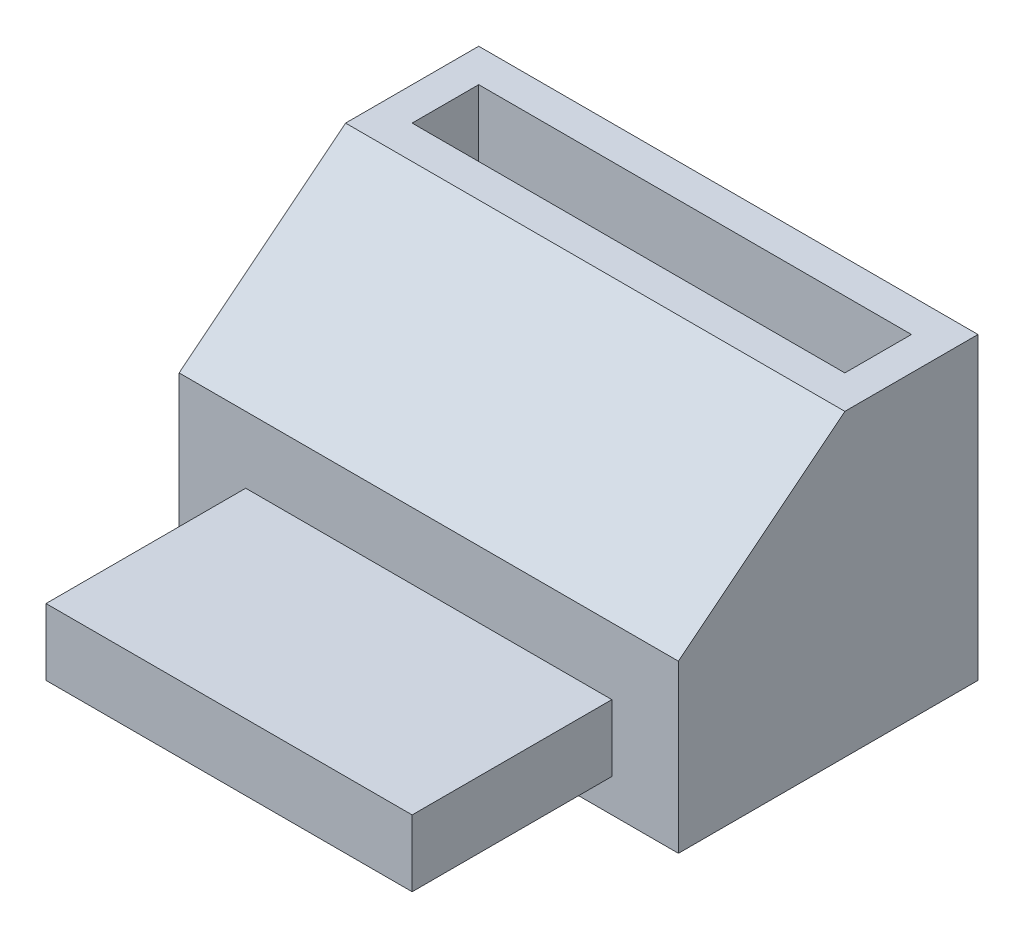
ISO-10303-21;
HEADER;
FILE_DESCRIPTION(('STEP AP214'),'2;1');
FILE_NAME('part.step','',(''),(''),'','','');
FILE_SCHEMA(('AUTOMOTIVE_DESIGN { 1 0 10303 214 1 1 1 1 }'));
ENDSEC;
DATA;
#1=APPLICATION_CONTEXT('core data for automotive mechanical design processes');
#2=APPLICATION_PROTOCOL_DEFINITION('international standard','automotive_design',2000,#1);
#3=PRODUCT_CONTEXT('',#1,'mechanical');
#4=PRODUCT('Part','Part','',(#3));
#5=PRODUCT_RELATED_PRODUCT_CATEGORY('part','',(#4));
#6=PRODUCT_DEFINITION_FORMATION('','',#4);
#7=PRODUCT_DEFINITION_CONTEXT('part definition',#1,'design');
#8=PRODUCT_DEFINITION('design','',#6,#7);
#9=PRODUCT_DEFINITION_SHAPE('','',#8);
#10=(LENGTH_UNIT() NAMED_UNIT(*) SI_UNIT(.MILLI.,.METRE.));
#11=(NAMED_UNIT(*) PLANE_ANGLE_UNIT() SI_UNIT($,.RADIAN.));
#12=(NAMED_UNIT(*) SI_UNIT($,.STERADIAN.) SOLID_ANGLE_UNIT());
#13=UNCERTAINTY_MEASURE_WITH_UNIT(LENGTH_MEASURE(1.E-05),#10,'distance_accuracy_value','');
#14=(GEOMETRIC_REPRESENTATION_CONTEXT(3) GLOBAL_UNCERTAINTY_ASSIGNED_CONTEXT((#13)) GLOBAL_UNIT_ASSIGNED_CONTEXT((#10,
#11,#12)) REPRESENTATION_CONTEXT('',''));
#15=CARTESIAN_POINT('',(0.,0.,0.));
#16=DIRECTION('',(0.,0.,1.));
#17=DIRECTION('',(1.,0.,0.));
#18=AXIS2_PLACEMENT_3D('',#15,#16,#17);
#19=CARTESIAN_POINT('',(150.,50.,90.));
#20=DIRECTION('',(0.,0.,-1.));
#21=DIRECTION('',(-1.,0.,0.));
#22=AXIS2_PLACEMENT_3D('',#19,#20,#21);
#23=PLANE('',#22);
#24=DIRECTION('',(0.,-1.,0.));
#25=VECTOR('',#24,1.);
#26=CARTESIAN_POINT('',(0.,50.,90.));
#27=LINE('',#26,#25);
#28=CARTESIAN_POINT('',(0.,50.,90.));
#29=VERTEX_POINT('',#28);
#30=CARTESIAN_POINT('',(0.,0.,90.));
#31=VERTEX_POINT('',#30);
#32=EDGE_CURVE('E203',#29,#31,#27,.T.);
#33=ORIENTED_EDGE('',*,*,#32,.T.);
#34=DIRECTION('',(-1.,0.,0.));
#35=VECTOR('',#34,1.);
#36=CARTESIAN_POINT('',(150.,0.,90.));
#37=LINE('',#36,#35);
#38=CARTESIAN_POINT('',(150.,0.,90.));
#39=VERTEX_POINT('',#38);
#40=EDGE_CURVE('E211',#39,#31,#37,.T.);
#41=ORIENTED_EDGE('',*,*,#40,.F.);
#42=DIRECTION('',(0.,-1.,0.));
#43=VECTOR('',#42,1.);
#44=CARTESIAN_POINT('',(150.,50.,90.));
#45=LINE('',#44,#43);
#46=CARTESIAN_POINT('',(150.,50.,90.));
#47=VERTEX_POINT('',#46);
#48=EDGE_CURVE('E209',#47,#39,#45,.T.);
#49=ORIENTED_EDGE('',*,*,#48,.F.);
#50=DIRECTION('',(-1.,0.,0.));
#51=VECTOR('',#50,1.);
#52=CARTESIAN_POINT('',(150.,50.,90.));
#53=LINE('',#52,#51);
#54=EDGE_CURVE('E223',#47,#29,#53,.T.);
#55=ORIENTED_EDGE('',*,*,#54,.T.);
#56=EDGE_LOOP('',(#33,#41,#49,#55));
#57=FACE_BOUND('',#56,.T.);
#58=DIRECTION('',(0.,-1.,0.));
#59=VECTOR('',#58,1.);
#60=CARTESIAN_POINT('',(20.,30.,90.));
#61=LINE('',#60,#59);
#62=CARTESIAN_POINT('',(20.,30.,90.));
#63=VERTEX_POINT('',#62);
#64=CARTESIAN_POINT('',(20.,10.,90.));
#65=VERTEX_POINT('',#64);
#66=EDGE_CURVE('E165',#63,#65,#61,.T.);
#67=ORIENTED_EDGE('',*,*,#66,.F.);
#68=DIRECTION('',(-1.,0.,0.));
#69=VECTOR('',#68,1.);
#70=CARTESIAN_POINT('',(20.,30.,90.));
#71=LINE('',#70,#69);
#72=CARTESIAN_POINT('',(130.,30.,90.));
#73=VERTEX_POINT('',#72);
#74=EDGE_CURVE('E173',#73,#63,#71,.T.);
#75=ORIENTED_EDGE('',*,*,#74,.F.);
#76=DIRECTION('',(0.,1.,0.));
#77=VECTOR('',#76,1.);
#78=CARTESIAN_POINT('',(130.,30.,90.));
#79=LINE('',#78,#77);
#80=CARTESIAN_POINT('',(130.,10.,90.));
#81=VERTEX_POINT('',#80);
#82=EDGE_CURVE('E183',#81,#73,#79,.T.);
#83=ORIENTED_EDGE('',*,*,#82,.F.);
#84=DIRECTION('',(1.,0.,0.));
#85=VECTOR('',#84,1.);
#86=CARTESIAN_POINT('',(20.,10.,90.));
#87=LINE('',#86,#85);
#88=EDGE_CURVE('E58',#65,#81,#87,.T.);
#89=ORIENTED_EDGE('',*,*,#88,.F.);
#90=EDGE_LOOP('',(#67,#75,#83,#89));
#91=FACE_BOUND('',#90,.T.);
#92=ADVANCED_FACE('F35',(#57,#91),#23,.F.);
#93=CARTESIAN_POINT('',(150.,0.,90.));
#94=DIRECTION('',(0.,1.,0.));
#95=DIRECTION('',(0.,0.,1.));
#96=AXIS2_PLACEMENT_3D('',#93,#94,#95);
#97=PLANE('',#96);
#98=DIRECTION('',(0.,0.,-1.));
#99=VECTOR('',#98,1.);
#100=CARTESIAN_POINT('',(0.,0.,90.));
#101=LINE('',#100,#99);
#102=CARTESIAN_POINT('',(0.,0.,0.));
#103=VERTEX_POINT('',#102);
#104=EDGE_CURVE('E198',#31,#103,#101,.T.);
#105=ORIENTED_EDGE('',*,*,#104,.T.);
#106=DIRECTION('',(-1.,0.,0.));
#107=VECTOR('',#106,1.);
#108=CARTESIAN_POINT('',(150.,0.,0.));
#109=LINE('',#108,#107);
#110=CARTESIAN_POINT('',(150.,0.,0.));
#111=VERTEX_POINT('',#110);
#112=EDGE_CURVE('E11',#111,#103,#109,.T.);
#113=ORIENTED_EDGE('',*,*,#112,.F.);
#114=DIRECTION('',(0.,0.,-1.));
#115=VECTOR('',#114,1.);
#116=CARTESIAN_POINT('',(150.,0.,90.));
#117=LINE('',#116,#115);
#118=EDGE_CURVE('E199',#39,#111,#117,.T.);
#119=ORIENTED_EDGE('',*,*,#118,.F.);
#120=ORIENTED_EDGE('',*,*,#40,.T.);
#121=EDGE_LOOP('',(#105,#113,#119,#120));
#122=FACE_BOUND('',#121,.T.);
#123=ADVANCED_FACE('F37',(#122),#97,.F.);
#124=CARTESIAN_POINT('',(150.,0.,0.));
#125=DIRECTION('',(0.,0.,1.));
#126=DIRECTION('',(1.,0.,0.));
#127=AXIS2_PLACEMENT_3D('',#124,#125,#126);
#128=PLANE('',#127);
#129=DIRECTION('',(0.,1.,0.));
#130=VECTOR('',#129,1.);
#131=CARTESIAN_POINT('',(0.,0.,0.));
#132=LINE('',#131,#130);
#133=CARTESIAN_POINT('',(0.,90.,0.));
#134=VERTEX_POINT('',#133);
#135=EDGE_CURVE('E214',#103,#134,#132,.T.);
#136=ORIENTED_EDGE('',*,*,#135,.T.);
#137=DIRECTION('',(-1.,0.,0.));
#138=VECTOR('',#137,1.);
#139=CARTESIAN_POINT('',(150.,90.,0.));
#140=LINE('',#139,#138);
#141=CARTESIAN_POINT('',(150.,90.,0.));
#142=VERTEX_POINT('',#141);
#143=EDGE_CURVE('E43',#142,#134,#140,.T.);
#144=ORIENTED_EDGE('',*,*,#143,.F.);
#145=DIRECTION('',(0.,1.,0.));
#146=VECTOR('',#145,1.);
#147=CARTESIAN_POINT('',(150.,0.,0.));
#148=LINE('',#147,#146);
#149=EDGE_CURVE('E202',#111,#142,#148,.T.);
#150=ORIENTED_EDGE('',*,*,#149,.F.);
#151=ORIENTED_EDGE('',*,*,#112,.T.);
#152=EDGE_LOOP('',(#136,#144,#150,#151));
#153=FACE_BOUND('',#152,.T.);
#154=ADVANCED_FACE('F252',(#153),#128,.F.);
#155=CARTESIAN_POINT('',(150.,90.,0.));
#156=DIRECTION('',(0.,-1.,0.));
#157=DIRECTION('',(0.,0.,-1.));
#158=AXIS2_PLACEMENT_3D('',#155,#156,#157);
#159=PLANE('',#158);
#160=DIRECTION('',(1.,0.,0.));
#161=VECTOR('',#160,1.);
#162=CARTESIAN_POINT('',(10.,90.,30.));
#163=LINE('',#162,#161);
#164=CARTESIAN_POINT('',(10.,90.,30.));
#165=VERTEX_POINT('',#164);
#166=CARTESIAN_POINT('',(140.,90.,30.));
#167=VERTEX_POINT('',#166);
#168=EDGE_CURVE('E159',#165,#167,#163,.T.);
#169=ORIENTED_EDGE('',*,*,#168,.F.);
#170=DIRECTION('',(0.,0.,1.));
#171=VECTOR('',#170,1.);
#172=CARTESIAN_POINT('',(10.,90.,10.));
#173=LINE('',#172,#171);
#174=CARTESIAN_POINT('',(10.,90.,10.));
#175=VERTEX_POINT('',#174);
#176=EDGE_CURVE('E50',#175,#165,#173,.T.);
#177=ORIENTED_EDGE('',*,*,#176,.F.);
#178=DIRECTION('',(-1.,0.,0.));
#179=VECTOR('',#178,1.);
#180=CARTESIAN_POINT('',(10.,90.,10.));
#181=LINE('',#180,#179);
#182=CARTESIAN_POINT('',(140.,90.,10.));
#183=VERTEX_POINT('',#182);
#184=EDGE_CURVE('E150',#183,#175,#181,.T.);
#185=ORIENTED_EDGE('',*,*,#184,.F.);
#186=DIRECTION('',(0.,0.,-1.));
#187=VECTOR('',#186,1.);
#188=CARTESIAN_POINT('',(140.,90.,10.));
#189=LINE('',#188,#187);
#190=EDGE_CURVE('E153',#167,#183,#189,.T.);
#191=ORIENTED_EDGE('',*,*,#190,.F.);
#192=EDGE_LOOP('',(#169,#177,#185,#191));
#193=FACE_BOUND('',#192,.T.);
#194=DIRECTION('',(0.,0.,1.));
#195=VECTOR('',#194,1.);
#196=CARTESIAN_POINT('',(0.,90.,0.));
#197=LINE('',#196,#195);
#198=CARTESIAN_POINT('',(0.,90.,40.));
#199=VERTEX_POINT('',#198);
#200=EDGE_CURVE('E216',#134,#199,#197,.T.);
#201=ORIENTED_EDGE('',*,*,#200,.T.);
#202=DIRECTION('',(-1.,0.,0.));
#203=VECTOR('',#202,1.);
#204=CARTESIAN_POINT('',(150.,90.,40.));
#205=LINE('',#204,#203);
#206=CARTESIAN_POINT('',(150.,90.,40.));
#207=VERTEX_POINT('',#206);
#208=EDGE_CURVE('E226',#207,#199,#205,.T.);
#209=ORIENTED_EDGE('',*,*,#208,.F.);
#210=DIRECTION('',(0.,0.,1.));
#211=VECTOR('',#210,1.);
#212=CARTESIAN_POINT('',(150.,90.,0.));
#213=LINE('',#212,#211);
#214=EDGE_CURVE('E205',#142,#207,#213,.T.);
#215=ORIENTED_EDGE('',*,*,#214,.F.);
#216=ORIENTED_EDGE('',*,*,#143,.T.);
#217=EDGE_LOOP('',(#201,#209,#215,#216));
#218=FACE_BOUND('',#217,.T.);
#219=ADVANCED_FACE('F233',(#193,#218),#159,.F.);
#220=CARTESIAN_POINT('',(150.,90.,40.));
#221=DIRECTION('',(0.,-0.78086880944303,-0.624695047554424));
#222=DIRECTION('',(0.,0.624695047554424,-0.78086880944303));
#223=AXIS2_PLACEMENT_3D('',#220,#221,#222);
#224=PLANE('',#223);
#225=DIRECTION('',(0.,-0.624695047554424,0.78086880944303));
#226=VECTOR('',#225,1.);
#227=CARTESIAN_POINT('',(0.,90.,40.));
#228=LINE('',#227,#226);
#229=EDGE_CURVE('E218',#199,#29,#228,.T.);
#230=ORIENTED_EDGE('',*,*,#229,.T.);
#231=ORIENTED_EDGE('',*,*,#54,.F.);
#232=DIRECTION('',(0.,-0.624695047554424,0.78086880944303));
#233=VECTOR('',#232,1.);
#234=CARTESIAN_POINT('',(150.,90.,40.));
#235=LINE('',#234,#233);
#236=EDGE_CURVE('E207',#207,#47,#235,.T.);
#237=ORIENTED_EDGE('',*,*,#236,.F.);
#238=ORIENTED_EDGE('',*,*,#208,.T.);
#239=EDGE_LOOP('',(#230,#231,#237,#238));
#240=FACE_BOUND('',#239,.T.);
#241=ADVANCED_FACE('F243',(#240),#224,.F.);
#242=CARTESIAN_POINT('',(150.,0.,0.));
#243=DIRECTION('',(1.,0.,0.));
#244=DIRECTION('',(0.,0.,-1.));
#245=AXIS2_PLACEMENT_3D('',#242,#243,#244);
#246=PLANE('',#245);
#247=ORIENTED_EDGE('',*,*,#118,.T.);
#248=ORIENTED_EDGE('',*,*,#149,.T.);
#249=ORIENTED_EDGE('',*,*,#214,.T.);
#250=ORIENTED_EDGE('',*,*,#236,.T.);
#251=ORIENTED_EDGE('',*,*,#48,.T.);
#252=EDGE_LOOP('',(#247,#248,#249,#250,#251));
#253=FACE_BOUND('',#252,.T.);
#254=ADVANCED_FACE('F250',(#253),#246,.T.);
#255=CARTESIAN_POINT('',(0.,0.,0.));
#256=DIRECTION('',(1.,0.,0.));
#257=DIRECTION('',(0.,0.,-1.));
#258=AXIS2_PLACEMENT_3D('',#255,#256,#257);
#259=PLANE('',#258);
#260=ORIENTED_EDGE('',*,*,#104,.F.);
#261=ORIENTED_EDGE('',*,*,#32,.F.);
#262=ORIENTED_EDGE('',*,*,#229,.F.);
#263=ORIENTED_EDGE('',*,*,#200,.F.);
#264=ORIENTED_EDGE('',*,*,#135,.F.);
#265=EDGE_LOOP('',(#260,#261,#262,#263,#264));
#266=FACE_BOUND('',#265,.T.);
#267=ADVANCED_FACE('F239',(#266),#259,.F.);
#268=CARTESIAN_POINT('',(20.,30.,150.));
#269=DIRECTION('',(1.,0.,0.));
#270=DIRECTION('',(0.,1.,0.));
#271=AXIS2_PLACEMENT_3D('',#268,#269,#270);
#272=PLANE('',#271);
#273=ORIENTED_EDGE('',*,*,#66,.T.);
#274=DIRECTION('',(0.,0.,-1.));
#275=VECTOR('',#274,1.);
#276=CARTESIAN_POINT('',(20.,10.,150.));
#277=LINE('',#276,#275);
#278=CARTESIAN_POINT('',(20.,10.,150.));
#279=VERTEX_POINT('',#278);
#280=EDGE_CURVE('E196',#279,#65,#277,.T.);
#281=ORIENTED_EDGE('',*,*,#280,.F.);
#282=DIRECTION('',(0.,-1.,0.));
#283=VECTOR('',#282,1.);
#284=CARTESIAN_POINT('',(20.,30.,150.));
#285=LINE('',#284,#283);
#286=CARTESIAN_POINT('',(20.,30.,150.));
#287=VERTEX_POINT('',#286);
#288=EDGE_CURVE('E169',#287,#279,#285,.T.);
#289=ORIENTED_EDGE('',*,*,#288,.F.);
#290=DIRECTION('',(0.,0.,-1.));
#291=VECTOR('',#290,1.);
#292=CARTESIAN_POINT('',(20.,30.,150.));
#293=LINE('',#292,#291);
#294=EDGE_CURVE('E179',#287,#63,#293,.T.);
#295=ORIENTED_EDGE('',*,*,#294,.T.);
#296=EDGE_LOOP('',(#273,#281,#289,#295));
#297=FACE_BOUND('',#296,.T.);
#298=ADVANCED_FACE('F304',(#297),#272,.F.);
#299=CARTESIAN_POINT('',(20.,10.,150.));
#300=DIRECTION('',(0.,1.,0.));
#301=DIRECTION('',(-1.,0.,0.));
#302=AXIS2_PLACEMENT_3D('',#299,#300,#301);
#303=PLANE('',#302);
#304=ORIENTED_EDGE('',*,*,#88,.T.);
#305=DIRECTION('',(0.,0.,-1.));
#306=VECTOR('',#305,1.);
#307=CARTESIAN_POINT('',(130.,10.,150.));
#308=LINE('',#307,#306);
#309=CARTESIAN_POINT('',(130.,10.,150.));
#310=VERTEX_POINT('',#309);
#311=EDGE_CURVE('E193',#310,#81,#308,.T.);
#312=ORIENTED_EDGE('',*,*,#311,.F.);
#313=DIRECTION('',(1.,0.,0.));
#314=VECTOR('',#313,1.);
#315=CARTESIAN_POINT('',(20.,10.,150.));
#316=LINE('',#315,#314);
#317=EDGE_CURVE('E172',#279,#310,#316,.T.);
#318=ORIENTED_EDGE('',*,*,#317,.F.);
#319=ORIENTED_EDGE('',*,*,#280,.T.);
#320=EDGE_LOOP('',(#304,#312,#318,#319));
#321=FACE_BOUND('',#320,.T.);
#322=ADVANCED_FACE('F300',(#321),#303,.F.);
#323=CARTESIAN_POINT('',(130.,30.,150.));
#324=DIRECTION('',(-1.,0.,0.));
#325=DIRECTION('',(0.,0.,1.));
#326=AXIS2_PLACEMENT_3D('',#323,#324,#325);
#327=PLANE('',#326);
#328=ORIENTED_EDGE('',*,*,#82,.T.);
#329=DIRECTION('',(0.,0.,-1.));
#330=VECTOR('',#329,1.);
#331=CARTESIAN_POINT('',(130.,30.,150.));
#332=LINE('',#331,#330);
#333=CARTESIAN_POINT('',(130.,30.,150.));
#334=VERTEX_POINT('',#333);
#335=EDGE_CURVE('E190',#334,#73,#332,.T.);
#336=ORIENTED_EDGE('',*,*,#335,.F.);
#337=DIRECTION('',(0.,1.,0.));
#338=VECTOR('',#337,1.);
#339=CARTESIAN_POINT('',(130.,30.,150.));
#340=LINE('',#339,#338);
#341=EDGE_CURVE('E175',#310,#334,#340,.T.);
#342=ORIENTED_EDGE('',*,*,#341,.F.);
#343=ORIENTED_EDGE('',*,*,#311,.T.);
#344=EDGE_LOOP('',(#328,#336,#342,#343));
#345=FACE_BOUND('',#344,.T.);
#346=ADVANCED_FACE('F296',(#345),#327,.F.);
#347=CARTESIAN_POINT('',(20.,30.,150.));
#348=DIRECTION('',(0.,-1.,0.));
#349=DIRECTION('',(0.,0.,-1.));
#350=AXIS2_PLACEMENT_3D('',#347,#348,#349);
#351=PLANE('',#350);
#352=ORIENTED_EDGE('',*,*,#74,.T.);
#353=ORIENTED_EDGE('',*,*,#294,.F.);
#354=DIRECTION('',(-1.,0.,0.));
#355=VECTOR('',#354,1.);
#356=CARTESIAN_POINT('',(20.,30.,150.));
#357=LINE('',#356,#355);
#358=EDGE_CURVE('E177',#334,#287,#357,.T.);
#359=ORIENTED_EDGE('',*,*,#358,.F.);
#360=ORIENTED_EDGE('',*,*,#335,.T.);
#361=EDGE_LOOP('',(#352,#353,#359,#360));
#362=FACE_BOUND('',#361,.T.);
#363=ADVANCED_FACE('F292',(#362),#351,.F.);
#364=CARTESIAN_POINT('',(0.,0.,150.));
#365=DIRECTION('',(0.,0.,1.));
#366=DIRECTION('',(1.,0.,0.));
#367=AXIS2_PLACEMENT_3D('',#364,#365,#366);
#368=PLANE('',#367);
#369=ORIENTED_EDGE('',*,*,#288,.T.);
#370=ORIENTED_EDGE('',*,*,#317,.T.);
#371=ORIENTED_EDGE('',*,*,#341,.T.);
#372=ORIENTED_EDGE('',*,*,#358,.T.);
#373=EDGE_LOOP('',(#369,#370,#371,#372));
#374=FACE_BOUND('',#373,.T.);
#375=ADVANCED_FACE('F284',(#374),#368,.T.);
#376=CARTESIAN_POINT('',(10.,30.,10.));
#377=DIRECTION('',(-1.,0.,0.));
#378=DIRECTION('',(0.,0.,1.));
#379=AXIS2_PLACEMENT_3D('',#376,#377,#378);
#380=PLANE('',#379);
#381=ORIENTED_EDGE('',*,*,#176,.T.);
#382=DIRECTION('',(0.,1.,0.));
#383=VECTOR('',#382,1.);
#384=CARTESIAN_POINT('',(10.,30.,30.));
#385=LINE('',#384,#383);
#386=CARTESIAN_POINT('',(10.,30.,30.));
#387=VERTEX_POINT('',#386);
#388=EDGE_CURVE('E128',#387,#165,#385,.T.);
#389=ORIENTED_EDGE('',*,*,#388,.F.);
#390=DIRECTION('',(0.,0.,1.));
#391=VECTOR('',#390,1.);
#392=CARTESIAN_POINT('',(10.,30.,10.));
#393=LINE('',#392,#391);
#394=CARTESIAN_POINT('',(10.,30.,10.));
#395=VERTEX_POINT('',#394);
#396=EDGE_CURVE('E132',#395,#387,#393,.T.);
#397=ORIENTED_EDGE('',*,*,#396,.F.);
#398=DIRECTION('',(0.,1.,0.));
#399=VECTOR('',#398,1.);
#400=CARTESIAN_POINT('',(10.,30.,10.));
#401=LINE('',#400,#399);
#402=EDGE_CURVE('E163',#395,#175,#401,.T.);
#403=ORIENTED_EDGE('',*,*,#402,.T.);
#404=EDGE_LOOP('',(#381,#389,#397,#403));
#405=FACE_BOUND('',#404,.T.);
#406=ADVANCED_FACE('F130',(#405),#380,.F.);
#407=CARTESIAN_POINT('',(10.,30.,10.));
#408=DIRECTION('',(0.,0.,-1.));
#409=DIRECTION('',(-1.,0.,0.));
#410=AXIS2_PLACEMENT_3D('',#407,#408,#409);
#411=PLANE('',#410);
#412=ORIENTED_EDGE('',*,*,#184,.T.);
#413=ORIENTED_EDGE('',*,*,#402,.F.);
#414=DIRECTION('',(-1.,0.,0.));
#415=VECTOR('',#414,1.);
#416=CARTESIAN_POINT('',(10.,30.,10.));
#417=LINE('',#416,#415);
#418=CARTESIAN_POINT('',(140.,30.,10.));
#419=VERTEX_POINT('',#418);
#420=EDGE_CURVE('E138',#419,#395,#417,.T.);
#421=ORIENTED_EDGE('',*,*,#420,.F.);
#422=DIRECTION('',(0.,1.,0.));
#423=VECTOR('',#422,1.);
#424=CARTESIAN_POINT('',(140.,30.,10.));
#425=LINE('',#424,#423);
#426=EDGE_CURVE('E166',#419,#183,#425,.T.);
#427=ORIENTED_EDGE('',*,*,#426,.T.);
#428=EDGE_LOOP('',(#412,#413,#421,#427));
#429=FACE_BOUND('',#428,.T.);
#430=ADVANCED_FACE('F276',(#429),#411,.F.);
#431=CARTESIAN_POINT('',(140.,30.,10.));
#432=DIRECTION('',(1.,0.,0.));
#433=DIRECTION('',(0.,0.,-1.));
#434=AXIS2_PLACEMENT_3D('',#431,#432,#433);
#435=PLANE('',#434);
#436=ORIENTED_EDGE('',*,*,#190,.T.);
#437=ORIENTED_EDGE('',*,*,#426,.F.);
#438=DIRECTION('',(0.,0.,-1.));
#439=VECTOR('',#438,1.);
#440=CARTESIAN_POINT('',(140.,30.,10.));
#441=LINE('',#440,#439);
#442=CARTESIAN_POINT('',(140.,30.,30.));
#443=VERTEX_POINT('',#442);
#444=EDGE_CURVE('E146',#443,#419,#441,.T.);
#445=ORIENTED_EDGE('',*,*,#444,.F.);
#446=DIRECTION('',(0.,1.,0.));
#447=VECTOR('',#446,1.);
#448=CARTESIAN_POINT('',(140.,30.,30.));
#449=LINE('',#448,#447);
#450=EDGE_CURVE('E137',#443,#167,#449,.T.);
#451=ORIENTED_EDGE('',*,*,#450,.T.);
#452=EDGE_LOOP('',(#436,#437,#445,#451));
#453=FACE_BOUND('',#452,.T.);
#454=ADVANCED_FACE('F274',(#453),#435,.F.);
#455=CARTESIAN_POINT('',(10.,30.,30.));
#456=DIRECTION('',(0.,0.,1.));
#457=DIRECTION('',(1.,0.,0.));
#458=AXIS2_PLACEMENT_3D('',#455,#456,#457);
#459=PLANE('',#458);
#460=ORIENTED_EDGE('',*,*,#168,.T.);
#461=ORIENTED_EDGE('',*,*,#450,.F.);
#462=DIRECTION('',(1.,0.,0.));
#463=VECTOR('',#462,1.);
#464=CARTESIAN_POINT('',(10.,30.,30.));
#465=LINE('',#464,#463);
#466=EDGE_CURVE('E141',#387,#443,#465,.T.);
#467=ORIENTED_EDGE('',*,*,#466,.F.);
#468=ORIENTED_EDGE('',*,*,#388,.T.);
#469=EDGE_LOOP('',(#460,#461,#467,#468));
#470=FACE_BOUND('',#469,.T.);
#471=ADVANCED_FACE('F142',(#470),#459,.F.);
#472=CARTESIAN_POINT('',(0.,30.,0.));
#473=DIRECTION('',(0.,1.,0.));
#474=DIRECTION('',(0.,0.,1.));
#475=AXIS2_PLACEMENT_3D('',#472,#473,#474);
#476=PLANE('',#475);
#477=ORIENTED_EDGE('',*,*,#396,.T.);
#478=ORIENTED_EDGE('',*,*,#466,.T.);
#479=ORIENTED_EDGE('',*,*,#444,.T.);
#480=ORIENTED_EDGE('',*,*,#420,.T.);
#481=EDGE_LOOP('',(#477,#478,#479,#480));
#482=FACE_BOUND('',#481,.T.);
#483=ADVANCED_FACE('F148',(#482),#476,.T.);
#484=CLOSED_SHELL('',(#92,#123,#154,#219,#241,#254,#267,#298,#322,#346,#363,#375,#406,#430,#454,
#471,#483));
#485=MANIFOLD_SOLID_BREP('B2',#484);
#486=ADVANCED_BREP_SHAPE_REPRESENTATION('',(#18,#485),#14);
#487=SHAPE_DEFINITION_REPRESENTATION(#9,#486);
ENDSEC;
END-ISO-10303-21;
